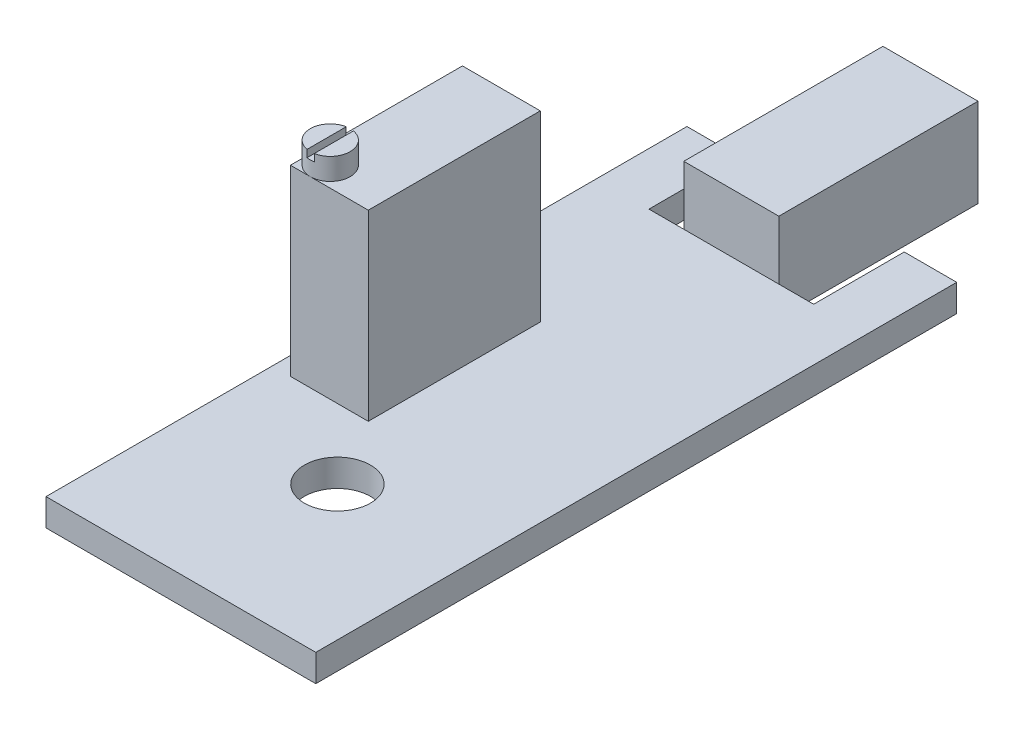
ISO-10303-21;
HEADER;
FILE_DESCRIPTION(('STEP AP214'),'2;1');
FILE_NAME('part.step','',(''),(''),'','','');
FILE_SCHEMA(('AUTOMOTIVE_DESIGN { 1 0 10303 214 1 1 1 1 }'));
ENDSEC;
DATA;
#1=APPLICATION_CONTEXT('core data for automotive mechanical design processes');
#2=APPLICATION_PROTOCOL_DEFINITION('international standard','automotive_design',2000,#1);
#3=PRODUCT_CONTEXT('',#1,'mechanical');
#4=PRODUCT('Part','Part','',(#3));
#5=PRODUCT_RELATED_PRODUCT_CATEGORY('part','',(#4));
#6=PRODUCT_DEFINITION_FORMATION('','',#4);
#7=PRODUCT_DEFINITION_CONTEXT('part definition',#1,'design');
#8=PRODUCT_DEFINITION('design','',#6,#7);
#9=PRODUCT_DEFINITION_SHAPE('','',#8);
#10=(LENGTH_UNIT() NAMED_UNIT(*) SI_UNIT(.MILLI.,.METRE.));
#11=(NAMED_UNIT(*) PLANE_ANGLE_UNIT() SI_UNIT($,.RADIAN.));
#12=(NAMED_UNIT(*) SI_UNIT($,.STERADIAN.) SOLID_ANGLE_UNIT());
#13=UNCERTAINTY_MEASURE_WITH_UNIT(LENGTH_MEASURE(1.E-05),#10,'distance_accuracy_value','');
#14=(GEOMETRIC_REPRESENTATION_CONTEXT(3) GLOBAL_UNCERTAINTY_ASSIGNED_CONTEXT((#13)) GLOBAL_UNIT_ASSIGNED_CONTEXT((#10,
#11,#12)) REPRESENTATION_CONTEXT('',''));
#15=CARTESIAN_POINT('',(0.,0.,0.));
#16=DIRECTION('',(0.,0.,1.));
#17=DIRECTION('',(1.,0.,0.));
#18=AXIS2_PLACEMENT_3D('',#15,#16,#17);
#19=CARTESIAN_POINT('',(-5.35,12.05,4.1));
#20=DIRECTION('',(0.,1.,0.));
#21=DIRECTION('',(0.,0.,1.));
#22=AXIS2_PLACEMENT_3D('',#19,#20,#21);
#23=PLANE('',#22);
#24=DIRECTION('',(0.,0.,-1.));
#25=VECTOR('',#24,1.);
#26=CARTESIAN_POINT('',(-5.15,12.05,3.0183346173608));
#27=LINE('',#26,#25);
#28=CARTESIAN_POINT('',(-5.15,12.05,5.18166538263919));
#29=VERTEX_POINT('',#28);
#30=CARTESIAN_POINT('',(-5.15,12.05,3.0183346173608));
#31=VERTEX_POINT('',#30);
#32=EDGE_CURVE('E206',#29,#31,#27,.T.);
#33=ORIENTED_EDGE('',*,*,#32,.F.);
#34=CARTESIAN_POINT('',(-5.35,12.05,4.1));
#35=DIRECTION('',(0.,1.,0.));
#36=DIRECTION('',(0.,0.,1.));
#37=AXIS2_PLACEMENT_3D('',#34,#35,#36);
#38=CIRCLE('',#37,1.1);
#39=EDGE_CURVE('E220',#29,#31,#38,.T.);
#40=ORIENTED_EDGE('',*,*,#39,.T.);
#41=EDGE_LOOP('',(#33,#40));
#42=FACE_BOUND('',#41,.T.);
#43=ADVANCED_FACE('F36',(#42),#23,.T.);
#44=CARTESIAN_POINT('',(0.,10.85,0.));
#45=DIRECTION('',(0.,-1.,0.));
#46=DIRECTION('',(0.,0.,-1.));
#47=AXIS2_PLACEMENT_3D('',#44,#45,#46);
#48=PLANE('',#47);
#49=CARTESIAN_POINT('',(-5.35,10.85,4.1));
#50=DIRECTION('',(0.,1.,0.));
#51=DIRECTION('',(0.,0.,1.));
#52=AXIS2_PLACEMENT_3D('',#49,#50,#51);
#53=CIRCLE('',#52,1.1);
#54=CARTESIAN_POINT('',(-5.35,10.85,5.2));
#55=VERTEX_POINT('',#54);
#56=CARTESIAN_POINT('',(-6.45,10.85,4.1));
#57=VERTEX_POINT('',#56);
#58=EDGE_CURVE('E46',#55,#57,#53,.T.);
#59=ORIENTED_EDGE('',*,*,#58,.F.);
#60=DIRECTION('',(1.,0.,0.));
#61=VECTOR('',#60,1.);
#62=CARTESIAN_POINT('',(-6.45,10.85,5.2));
#63=LINE('',#62,#61);
#64=CARTESIAN_POINT('',(-2.15,10.85,5.2));
#65=VERTEX_POINT('',#64);
#66=EDGE_CURVE('E236',#55,#65,#63,.T.);
#67=ORIENTED_EDGE('',*,*,#66,.T.);
#68=DIRECTION('',(0.,0.,-1.));
#69=VECTOR('',#68,1.);
#70=CARTESIAN_POINT('',(-2.15,10.85,5.2));
#71=LINE('',#70,#69);
#72=CARTESIAN_POINT('',(-2.15,10.85,-4.3));
#73=VERTEX_POINT('',#72);
#74=EDGE_CURVE('E226',#65,#73,#71,.T.);
#75=ORIENTED_EDGE('',*,*,#74,.T.);
#76=DIRECTION('',(-1.,0.,0.));
#77=VECTOR('',#76,1.);
#78=CARTESIAN_POINT('',(-6.45,10.85,-4.3));
#79=LINE('',#78,#77);
#80=CARTESIAN_POINT('',(-6.45,10.85,-4.3));
#81=VERTEX_POINT('',#80);
#82=EDGE_CURVE('E229',#73,#81,#79,.T.);
#83=ORIENTED_EDGE('',*,*,#82,.T.);
#84=DIRECTION('',(0.,0.,1.));
#85=VECTOR('',#84,1.);
#86=CARTESIAN_POINT('',(-6.45,10.85,5.2));
#87=LINE('',#86,#85);
#88=EDGE_CURVE('E233',#81,#57,#87,.T.);
#89=ORIENTED_EDGE('',*,*,#88,.T.);
#90=EDGE_LOOP('',(#59,#67,#75,#83,#89));
#91=FACE_BOUND('',#90,.T.);
#92=ADVANCED_FACE('F436',(#91),#48,.F.);
#93=CARTESIAN_POINT('',(0.,0.75,0.));
#94=DIRECTION('',(0.,1.,0.));
#95=DIRECTION('',(0.,0.,1.));
#96=AXIS2_PLACEMENT_3D('',#93,#94,#95);
#97=PLANE('',#96);
#98=CARTESIAN_POINT('',(0.,0.75,9.055));
#99=DIRECTION('',(0.,1.,0.));
#100=DIRECTION('',(0.,0.,1.));
#101=AXIS2_PLACEMENT_3D('',#98,#99,#100);
#102=CIRCLE('',#101,1.825);
#103=CARTESIAN_POINT('',(0.,0.75,10.88));
#104=VERTEX_POINT('',#103);
#105=EDGE_CURVE('E297',#104,#104,#102,.T.);
#106=ORIENTED_EDGE('',*,*,#105,.F.);
#107=EDGE_LOOP('',(#106));
#108=FACE_BOUND('',#107,.T.);
#109=DIRECTION('',(0.,0.,1.));
#110=VECTOR('',#109,1.);
#111=CARTESIAN_POINT('',(-4.54999999999994,0.75,0.));
#112=LINE('',#111,#110);
#113=CARTESIAN_POINT('',(-4.55,0.75,-17.7));
#114=VERTEX_POINT('',#113);
#115=CARTESIAN_POINT('',(-4.54999999999998,0.75,-12.7));
#116=VERTEX_POINT('',#115);
#117=EDGE_CURVE('E300',#114,#116,#112,.T.);
#118=ORIENTED_EDGE('',*,*,#117,.F.);
#119=DIRECTION('',(1.,0.,0.));
#120=VECTOR('',#119,1.);
#121=CARTESIAN_POINT('',(0.,0.75,-17.7));
#122=LINE('',#121,#120);
#123=CARTESIAN_POINT('',(-7.45,0.75,-17.7));
#124=VERTEX_POINT('',#123);
#125=EDGE_CURVE('E304',#124,#114,#122,.T.);
#126=ORIENTED_EDGE('',*,*,#125,.F.);
#127=DIRECTION('',(0.,0.,1.));
#128=VECTOR('',#127,1.);
#129=CARTESIAN_POINT('',(-7.45,0.75,0.));
#130=LINE('',#129,#128);
#131=CARTESIAN_POINT('',(-7.45,0.75,17.7));
#132=VERTEX_POINT('',#131);
#133=EDGE_CURVE('E307',#124,#132,#130,.T.);
#134=ORIENTED_EDGE('',*,*,#133,.T.);
#135=DIRECTION('',(1.,0.,0.));
#136=VECTOR('',#135,1.);
#137=CARTESIAN_POINT('',(0.,0.75,17.7));
#138=LINE('',#137,#136);
#139=CARTESIAN_POINT('',(7.45,0.75,17.7));
#140=VERTEX_POINT('',#139);
#141=EDGE_CURVE('E310',#132,#140,#138,.T.);
#142=ORIENTED_EDGE('',*,*,#141,.T.);
#143=DIRECTION('',(0.,0.,1.));
#144=VECTOR('',#143,1.);
#145=CARTESIAN_POINT('',(7.45,0.75,0.));
#146=LINE('',#145,#144);
#147=CARTESIAN_POINT('',(7.45,0.75,-17.7));
#148=VERTEX_POINT('',#147);
#149=EDGE_CURVE('E312',#148,#140,#146,.T.);
#150=ORIENTED_EDGE('',*,*,#149,.F.);
#151=DIRECTION('',(-1.,0.,0.));
#152=VECTOR('',#151,1.);
#153=CARTESIAN_POINT('',(0.,0.75,-17.7));
#154=LINE('',#153,#152);
#155=CARTESIAN_POINT('',(4.55,0.75,-17.7));
#156=VERTEX_POINT('',#155);
#157=EDGE_CURVE('E315',#148,#156,#154,.T.);
#158=ORIENTED_EDGE('',*,*,#157,.T.);
#159=DIRECTION('',(0.,0.,1.));
#160=VECTOR('',#159,1.);
#161=CARTESIAN_POINT('',(4.54999999999994,0.75,0.));
#162=LINE('',#161,#160);
#163=CARTESIAN_POINT('',(4.54999999999998,0.75,-12.7));
#164=VERTEX_POINT('',#163);
#165=EDGE_CURVE('E318',#156,#164,#162,.T.);
#166=ORIENTED_EDGE('',*,*,#165,.T.);
#167=DIRECTION('',(-1.,0.,0.));
#168=VECTOR('',#167,1.);
#169=CARTESIAN_POINT('',(0.,0.75,-12.7));
#170=LINE('',#169,#168);
#171=CARTESIAN_POINT('',(2.625,0.75,-12.7));
#172=VERTEX_POINT('',#171);
#173=EDGE_CURVE('E322',#164,#172,#170,.T.);
#174=ORIENTED_EDGE('',*,*,#173,.T.);
#175=DIRECTION('',(1.,0.,0.));
#176=VECTOR('',#175,1.);
#177=CARTESIAN_POINT('',(0.,0.75,-12.7));
#178=LINE('',#177,#176);
#179=CARTESIAN_POINT('',(-2.625,0.75,-12.7));
#180=VERTEX_POINT('',#179);
#181=EDGE_CURVE('E282',#180,#172,#178,.T.);
#182=ORIENTED_EDGE('',*,*,#181,.F.);
#183=EDGE_CURVE('E321',#180,#116,#170,.T.);
#184=ORIENTED_EDGE('',*,*,#183,.T.);
#185=EDGE_LOOP('',(#118,#126,#134,#142,#150,#158,#166,#174,#182,#184));
#186=FACE_BOUND('',#185,.T.);
#187=DIRECTION('',(-1.,0.,0.));
#188=VECTOR('',#187,1.);
#189=CARTESIAN_POINT('',(-6.45,0.75,-4.3));
#190=LINE('',#189,#188);
#191=CARTESIAN_POINT('',(-2.15,0.75,-4.3));
#192=VERTEX_POINT('',#191);
#193=CARTESIAN_POINT('',(-6.45,0.75,-4.3));
#194=VERTEX_POINT('',#193);
#195=EDGE_CURVE('E242',#192,#194,#190,.T.);
#196=ORIENTED_EDGE('',*,*,#195,.F.);
#197=DIRECTION('',(0.,0.,-1.));
#198=VECTOR('',#197,1.);
#199=CARTESIAN_POINT('',(-2.15,0.75,5.2));
#200=LINE('',#199,#198);
#201=CARTESIAN_POINT('',(-2.15,0.75,5.2));
#202=VERTEX_POINT('',#201);
#203=EDGE_CURVE('E222',#202,#192,#200,.T.);
#204=ORIENTED_EDGE('',*,*,#203,.F.);
#205=DIRECTION('',(1.,0.,0.));
#206=VECTOR('',#205,1.);
#207=CARTESIAN_POINT('',(-6.45,0.75,5.2));
#208=LINE('',#207,#206);
#209=CARTESIAN_POINT('',(-6.45,0.75,5.2));
#210=VERTEX_POINT('',#209);
#211=EDGE_CURVE('E230',#210,#202,#208,.T.);
#212=ORIENTED_EDGE('',*,*,#211,.F.);
#213=DIRECTION('',(0.,0.,1.));
#214=VECTOR('',#213,1.);
#215=CARTESIAN_POINT('',(-6.45,0.75,5.2));
#216=LINE('',#215,#214);
#217=EDGE_CURVE('E244',#194,#210,#216,.T.);
#218=ORIENTED_EDGE('',*,*,#217,.F.);
#219=EDGE_LOOP('',(#196,#204,#212,#218));
#220=FACE_BOUND('',#219,.T.);
#221=ADVANCED_FACE('F389',(#108,#186,#220),#97,.T.);
#222=CARTESIAN_POINT('',(0.,0.75,-12.7));
#223=DIRECTION('',(0.,0.,1.));
#224=DIRECTION('',(1.,0.,0.));
#225=AXIS2_PLACEMENT_3D('',#222,#223,#224);
#226=PLANE('',#225);
#227=DIRECTION('',(0.,1.,0.));
#228=VECTOR('',#227,1.);
#229=CARTESIAN_POINT('',(-2.625,-0.9,-12.7));
#230=LINE('',#229,#228);
#231=CARTESIAN_POINT('',(-2.625,-0.75,-12.7));
#232=VERTEX_POINT('',#231);
#233=EDGE_CURVE('E291',#232,#180,#230,.T.);
#234=ORIENTED_EDGE('',*,*,#233,.F.);
#235=DIRECTION('',(-1.,0.,0.));
#236=VECTOR('',#235,1.);
#237=CARTESIAN_POINT('',(0.,-0.75,-12.7));
#238=LINE('',#237,#236);
#239=CARTESIAN_POINT('',(-4.54999999999998,-0.75,-12.7));
#240=VERTEX_POINT('',#239);
#241=EDGE_CURVE('E349',#232,#240,#238,.T.);
#242=ORIENTED_EDGE('',*,*,#241,.T.);
#243=DIRECTION('',(0.,-1.,0.));
#244=VECTOR('',#243,1.);
#245=CARTESIAN_POINT('',(-4.54999999999998,0.75,-12.7));
#246=LINE('',#245,#244);
#247=EDGE_CURVE('E325',#116,#240,#246,.T.);
#248=ORIENTED_EDGE('',*,*,#247,.F.);
#249=ORIENTED_EDGE('',*,*,#183,.F.);
#250=EDGE_LOOP('',(#234,#242,#248,#249));
#251=FACE_BOUND('',#250,.T.);
#252=ADVANCED_FACE('F395',(#251),#226,.F.);
#253=CARTESIAN_POINT('',(-4.54999999999994,0.75,0.));
#254=DIRECTION('',(1.,0.,0.));
#255=DIRECTION('',(0.,0.,-1.));
#256=AXIS2_PLACEMENT_3D('',#253,#254,#255);
#257=PLANE('',#256);
#258=DIRECTION('',(0.,0.,1.));
#259=VECTOR('',#258,1.);
#260=CARTESIAN_POINT('',(-4.54999999999994,-0.75,0.));
#261=LINE('',#260,#259);
#262=CARTESIAN_POINT('',(-4.55,-0.75,-17.7));
#263=VERTEX_POINT('',#262);
#264=EDGE_CURVE('E328',#263,#240,#261,.T.);
#265=ORIENTED_EDGE('',*,*,#264,.F.);
#266=DIRECTION('',(0.,-1.,0.));
#267=VECTOR('',#266,1.);
#268=CARTESIAN_POINT('',(-4.55,0.75,-17.7));
#269=LINE('',#268,#267);
#270=EDGE_CURVE('E40',#114,#263,#269,.T.);
#271=ORIENTED_EDGE('',*,*,#270,.F.);
#272=ORIENTED_EDGE('',*,*,#117,.T.);
#273=ORIENTED_EDGE('',*,*,#247,.T.);
#274=EDGE_LOOP('',(#265,#271,#272,#273));
#275=FACE_BOUND('',#274,.T.);
#276=ADVANCED_FACE('F378',(#275),#257,.T.);
#277=CARTESIAN_POINT('',(0.,0.75,-17.7));
#278=DIRECTION('',(0.,0.,-1.));
#279=DIRECTION('',(-1.,0.,0.));
#280=AXIS2_PLACEMENT_3D('',#277,#278,#279);
#281=PLANE('',#280);
#282=DIRECTION('',(1.,0.,0.));
#283=VECTOR('',#282,1.);
#284=CARTESIAN_POINT('',(0.,-0.75,-17.7));
#285=LINE('',#284,#283);
#286=CARTESIAN_POINT('',(-7.45,-0.75,-17.7));
#287=VERTEX_POINT('',#286);
#288=EDGE_CURVE('E331',#287,#263,#285,.T.);
#289=ORIENTED_EDGE('',*,*,#288,.F.);
#290=DIRECTION('',(0.,-1.,0.));
#291=VECTOR('',#290,1.);
#292=CARTESIAN_POINT('',(-7.45,0.75,-17.7));
#293=LINE('',#292,#291);
#294=EDGE_CURVE('E367',#124,#287,#293,.T.);
#295=ORIENTED_EDGE('',*,*,#294,.F.);
#296=ORIENTED_EDGE('',*,*,#125,.T.);
#297=ORIENTED_EDGE('',*,*,#270,.T.);
#298=EDGE_LOOP('',(#289,#295,#296,#297));
#299=FACE_BOUND('',#298,.T.);
#300=ADVANCED_FACE('F374',(#299),#281,.T.);
#301=CARTESIAN_POINT('',(-7.45,0.75,0.));
#302=DIRECTION('',(1.,0.,0.));
#303=DIRECTION('',(0.,0.,-1.));
#304=AXIS2_PLACEMENT_3D('',#301,#302,#303);
#305=PLANE('',#304);
#306=DIRECTION('',(0.,0.,1.));
#307=VECTOR('',#306,1.);
#308=CARTESIAN_POINT('',(-7.45,-0.75,0.));
#309=LINE('',#308,#307);
#310=CARTESIAN_POINT('',(-7.45,-0.75,17.7));
#311=VERTEX_POINT('',#310);
#312=EDGE_CURVE('E334',#287,#311,#309,.T.);
#313=ORIENTED_EDGE('',*,*,#312,.T.);
#314=DIRECTION('',(0.,-1.,0.));
#315=VECTOR('',#314,1.);
#316=CARTESIAN_POINT('',(-7.45,0.75,17.7));
#317=LINE('',#316,#315);
#318=EDGE_CURVE('E365',#132,#311,#317,.T.);
#319=ORIENTED_EDGE('',*,*,#318,.F.);
#320=ORIENTED_EDGE('',*,*,#133,.F.);
#321=ORIENTED_EDGE('',*,*,#294,.T.);
#322=EDGE_LOOP('',(#313,#319,#320,#321));
#323=FACE_BOUND('',#322,.T.);
#324=ADVANCED_FACE('F383',(#323),#305,.F.);
#325=CARTESIAN_POINT('',(0.,0.75,17.7));
#326=DIRECTION('',(0.,0.,-1.));
#327=DIRECTION('',(-1.,0.,0.));
#328=AXIS2_PLACEMENT_3D('',#325,#326,#327);
#329=PLANE('',#328);
#330=DIRECTION('',(1.,0.,0.));
#331=VECTOR('',#330,1.);
#332=CARTESIAN_POINT('',(0.,-0.75,17.7));
#333=LINE('',#332,#331);
#334=CARTESIAN_POINT('',(7.45,-0.75,17.7));
#335=VERTEX_POINT('',#334);
#336=EDGE_CURVE('E337',#311,#335,#333,.T.);
#337=ORIENTED_EDGE('',*,*,#336,.T.);
#338=DIRECTION('',(0.,-1.,0.));
#339=VECTOR('',#338,1.);
#340=CARTESIAN_POINT('',(7.45,0.75,17.7));
#341=LINE('',#340,#339);
#342=EDGE_CURVE('E363',#140,#335,#341,.T.);
#343=ORIENTED_EDGE('',*,*,#342,.F.);
#344=ORIENTED_EDGE('',*,*,#141,.F.);
#345=ORIENTED_EDGE('',*,*,#318,.T.);
#346=EDGE_LOOP('',(#337,#343,#344,#345));
#347=FACE_BOUND('',#346,.T.);
#348=ADVANCED_FACE('F385',(#347),#329,.F.);
#349=CARTESIAN_POINT('',(7.45,0.75,0.));
#350=DIRECTION('',(1.,0.,0.));
#351=DIRECTION('',(0.,0.,-1.));
#352=AXIS2_PLACEMENT_3D('',#349,#350,#351);
#353=PLANE('',#352);
#354=DIRECTION('',(0.,0.,1.));
#355=VECTOR('',#354,1.);
#356=CARTESIAN_POINT('',(7.45,-0.75,0.));
#357=LINE('',#356,#355);
#358=CARTESIAN_POINT('',(7.45,-0.75,-17.7));
#359=VERTEX_POINT('',#358);
#360=EDGE_CURVE('E340',#359,#335,#357,.T.);
#361=ORIENTED_EDGE('',*,*,#360,.F.);
#362=DIRECTION('',(0.,-1.,0.));
#363=VECTOR('',#362,1.);
#364=CARTESIAN_POINT('',(7.45,0.75,-17.7));
#365=LINE('',#364,#363);
#366=EDGE_CURVE('E361',#148,#359,#365,.T.);
#367=ORIENTED_EDGE('',*,*,#366,.F.);
#368=ORIENTED_EDGE('',*,*,#149,.T.);
#369=ORIENTED_EDGE('',*,*,#342,.T.);
#370=EDGE_LOOP('',(#361,#367,#368,#369));
#371=FACE_BOUND('',#370,.T.);
#372=ADVANCED_FACE('F600',(#371),#353,.T.);
#373=CARTESIAN_POINT('',(0.,0.75,-17.7));
#374=DIRECTION('',(0.,0.,1.));
#375=DIRECTION('',(1.,0.,0.));
#376=AXIS2_PLACEMENT_3D('',#373,#374,#375);
#377=PLANE('',#376);
#378=DIRECTION('',(-1.,0.,0.));
#379=VECTOR('',#378,1.);
#380=CARTESIAN_POINT('',(0.,-0.75,-17.7));
#381=LINE('',#380,#379);
#382=CARTESIAN_POINT('',(4.55,-0.75,-17.7));
#383=VERTEX_POINT('',#382);
#384=EDGE_CURVE('E343',#359,#383,#381,.T.);
#385=ORIENTED_EDGE('',*,*,#384,.T.);
#386=DIRECTION('',(0.,-1.,0.));
#387=VECTOR('',#386,1.);
#388=CARTESIAN_POINT('',(4.55,0.75,-17.7));
#389=LINE('',#388,#387);
#390=EDGE_CURVE('E358',#156,#383,#389,.T.);
#391=ORIENTED_EDGE('',*,*,#390,.F.);
#392=ORIENTED_EDGE('',*,*,#157,.F.);
#393=ORIENTED_EDGE('',*,*,#366,.T.);
#394=EDGE_LOOP('',(#385,#391,#392,#393));
#395=FACE_BOUND('',#394,.T.);
#396=ADVANCED_FACE('F607',(#395),#377,.F.);
#397=CARTESIAN_POINT('',(4.54999999999994,0.75,0.));
#398=DIRECTION('',(1.,0.,0.));
#399=DIRECTION('',(0.,0.,-1.));
#400=AXIS2_PLACEMENT_3D('',#397,#398,#399);
#401=PLANE('',#400);
#402=DIRECTION('',(0.,0.,1.));
#403=VECTOR('',#402,1.);
#404=CARTESIAN_POINT('',(4.54999999999994,-0.75,0.));
#405=LINE('',#404,#403);
#406=CARTESIAN_POINT('',(4.54999999999998,-0.75,-12.7));
#407=VERTEX_POINT('',#406);
#408=EDGE_CURVE('E346',#383,#407,#405,.T.);
#409=ORIENTED_EDGE('',*,*,#408,.T.);
#410=DIRECTION('',(0.,-1.,0.));
#411=VECTOR('',#410,1.);
#412=CARTESIAN_POINT('',(4.54999999999998,0.75,-12.7));
#413=LINE('',#412,#411);
#414=EDGE_CURVE('E355',#164,#407,#413,.T.);
#415=ORIENTED_EDGE('',*,*,#414,.F.);
#416=ORIENTED_EDGE('',*,*,#165,.F.);
#417=ORIENTED_EDGE('',*,*,#390,.T.);
#418=EDGE_LOOP('',(#409,#415,#416,#417));
#419=FACE_BOUND('',#418,.T.);
#420=ADVANCED_FACE('F615',(#419),#401,.F.);
#421=CARTESIAN_POINT('',(0.,0.75,9.055));
#422=DIRECTION('',(0.,-1.,0.));
#423=DIRECTION('',(0.,0.,-1.));
#424=AXIS2_PLACEMENT_3D('',#421,#422,#423);
#425=CYLINDRICAL_SURFACE('',#424,1.825);
#426=ORIENTED_EDGE('',*,*,#105,.T.);
#427=EDGE_LOOP('',(#426));
#428=FACE_BOUND('',#427,.T.);
#429=CARTESIAN_POINT('',(0.,-0.75,9.055));
#430=DIRECTION('',(0.,1.,0.));
#431=DIRECTION('',(0.,0.,1.));
#432=AXIS2_PLACEMENT_3D('',#429,#430,#431);
#433=CIRCLE('',#432,1.825);
#434=CARTESIAN_POINT('',(0.,-0.75,10.88));
#435=VERTEX_POINT('',#434);
#436=EDGE_CURVE('E296',#435,#435,#433,.T.);
#437=ORIENTED_EDGE('',*,*,#436,.F.);
#438=EDGE_LOOP('',(#437));
#439=FACE_BOUND('',#438,.T.);
#440=ADVANCED_FACE('F38',(#428,#439),#425,.F.);
#441=CARTESIAN_POINT('',(2.625,-0.75,-12.7));
#442=VERTEX_POINT('',#441);
#443=EDGE_CURVE('E301',#407,#442,#238,.T.);
#444=ORIENTED_EDGE('',*,*,#443,.T.);
#445=DIRECTION('',(0.,1.,0.));
#446=VECTOR('',#445,1.);
#447=CARTESIAN_POINT('',(2.625,-0.9,-12.7));
#448=LINE('',#447,#446);
#449=EDGE_CURVE('E286',#442,#172,#448,.T.);
#450=ORIENTED_EDGE('',*,*,#449,.T.);
#451=ORIENTED_EDGE('',*,*,#173,.F.);
#452=ORIENTED_EDGE('',*,*,#414,.T.);
#453=EDGE_LOOP('',(#444,#450,#451,#452));
#454=FACE_BOUND('',#453,.T.);
#455=ADVANCED_FACE('F575',(#454),#226,.F.);
#456=CARTESIAN_POINT('',(0.,-0.75,0.));
#457=DIRECTION('',(0.,1.,0.));
#458=DIRECTION('',(0.,0.,1.));
#459=AXIS2_PLACEMENT_3D('',#456,#457,#458);
#460=PLANE('',#459);
#461=ORIENTED_EDGE('',*,*,#436,.T.);
#462=EDGE_LOOP('',(#461));
#463=FACE_BOUND('',#462,.T.);
#464=ORIENTED_EDGE('',*,*,#264,.T.);
#465=ORIENTED_EDGE('',*,*,#241,.F.);
#466=EDGE_CURVE('E352',#442,#232,#238,.T.);
#467=ORIENTED_EDGE('',*,*,#466,.F.);
#468=ORIENTED_EDGE('',*,*,#443,.F.);
#469=ORIENTED_EDGE('',*,*,#408,.F.);
#470=ORIENTED_EDGE('',*,*,#384,.F.);
#471=ORIENTED_EDGE('',*,*,#360,.T.);
#472=ORIENTED_EDGE('',*,*,#336,.F.);
#473=ORIENTED_EDGE('',*,*,#312,.F.);
#474=ORIENTED_EDGE('',*,*,#288,.T.);
#475=EDGE_LOOP('',(#464,#465,#467,#468,#469,#470,#471,#472,#473,#474));
#476=FACE_BOUND('',#475,.T.);
#477=ADVANCED_FACE('F381',(#463,#476),#460,.F.);
#478=CARTESIAN_POINT('',(0.,-0.9,-12.7));
#479=DIRECTION('',(0.,0.,1.));
#480=DIRECTION('',(1.,0.,0.));
#481=AXIS2_PLACEMENT_3D('',#478,#479,#480);
#482=PLANE('',#481);
#483=ORIENTED_EDGE('',*,*,#466,.T.);
#484=CARTESIAN_POINT('',(-2.625,-0.9,-12.7));
#485=VERTEX_POINT('',#484);
#486=EDGE_CURVE('E288',#485,#232,#230,.T.);
#487=ORIENTED_EDGE('',*,*,#486,.F.);
#488=DIRECTION('',(1.,0.,0.));
#489=VECTOR('',#488,1.);
#490=CARTESIAN_POINT('',(0.,-0.9,-12.7));
#491=LINE('',#490,#489);
#492=CARTESIAN_POINT('',(2.625,-0.9,-12.7));
#493=VERTEX_POINT('',#492);
#494=EDGE_CURVE('E273',#485,#493,#491,.T.);
#495=ORIENTED_EDGE('',*,*,#494,.T.);
#496=EDGE_CURVE('E283',#493,#442,#448,.T.);
#497=ORIENTED_EDGE('',*,*,#496,.T.);
#498=EDGE_LOOP('',(#483,#487,#495,#497));
#499=FACE_BOUND('',#498,.T.);
#500=ADVANCED_FACE('F399',(#499),#482,.T.);
#501=CARTESIAN_POINT('',(0.,-0.9,-23.7));
#502=DIRECTION('',(0.,0.,1.));
#503=DIRECTION('',(1.,0.,0.));
#504=AXIS2_PLACEMENT_3D('',#501,#502,#503);
#505=PLANE('',#504);
#506=DIRECTION('',(0.,1.,0.));
#507=VECTOR('',#506,1.);
#508=CARTESIAN_POINT('',(-2.625,-0.9,-23.7));
#509=LINE('',#508,#507);
#510=CARTESIAN_POINT('',(-2.625,-0.9,-23.7));
#511=VERTEX_POINT('',#510);
#512=CARTESIAN_POINT('',(-2.625,4.,-23.7));
#513=VERTEX_POINT('',#512);
#514=EDGE_CURVE('E279',#511,#513,#509,.T.);
#515=ORIENTED_EDGE('',*,*,#514,.T.);
#516=DIRECTION('',(1.,0.,0.));
#517=VECTOR('',#516,1.);
#518=CARTESIAN_POINT('',(0.,4.,-23.7));
#519=LINE('',#518,#517);
#520=CARTESIAN_POINT('',(2.625,4.,-23.7));
#521=VERTEX_POINT('',#520);
#522=EDGE_CURVE('E257',#513,#521,#519,.T.);
#523=ORIENTED_EDGE('',*,*,#522,.T.);
#524=DIRECTION('',(0.,1.,0.));
#525=VECTOR('',#524,1.);
#526=CARTESIAN_POINT('',(2.625,-0.9,-23.7));
#527=LINE('',#526,#525);
#528=CARTESIAN_POINT('',(2.625,-0.9,-23.7));
#529=VERTEX_POINT('',#528);
#530=EDGE_CURVE('E280',#529,#521,#527,.T.);
#531=ORIENTED_EDGE('',*,*,#530,.F.);
#532=DIRECTION('',(1.,0.,0.));
#533=VECTOR('',#532,1.);
#534=CARTESIAN_POINT('',(0.,-0.9,-23.7));
#535=LINE('',#534,#533);
#536=EDGE_CURVE('E269',#511,#529,#535,.T.);
#537=ORIENTED_EDGE('',*,*,#536,.F.);
#538=EDGE_LOOP('',(#515,#523,#531,#537));
#539=FACE_BOUND('',#538,.T.);
#540=ADVANCED_FACE('F424',(#539),#505,.F.);
#541=CARTESIAN_POINT('',(2.625,-0.9,0.));
#542=DIRECTION('',(1.,0.,0.));
#543=DIRECTION('',(0.,0.,-1.));
#544=AXIS2_PLACEMENT_3D('',#541,#542,#543);
#545=PLANE('',#544);
#546=ORIENTED_EDGE('',*,*,#530,.T.);
#547=DIRECTION('',(0.,0.,-1.));
#548=VECTOR('',#547,1.);
#549=CARTESIAN_POINT('',(2.625,4.,0.));
#550=LINE('',#549,#548);
#551=CARTESIAN_POINT('',(2.625,4.,-12.7));
#552=VERTEX_POINT('',#551);
#553=EDGE_CURVE('E266',#552,#521,#550,.T.);
#554=ORIENTED_EDGE('',*,*,#553,.F.);
#555=EDGE_CURVE('E287',#172,#552,#448,.T.);
#556=ORIENTED_EDGE('',*,*,#555,.F.);
#557=ORIENTED_EDGE('',*,*,#449,.F.);
#558=ORIENTED_EDGE('',*,*,#496,.F.);
#559=DIRECTION('',(0.,0.,-1.));
#560=VECTOR('',#559,1.);
#561=CARTESIAN_POINT('',(2.625,-0.9,0.));
#562=LINE('',#561,#560);
#563=EDGE_CURVE('E276',#493,#529,#562,.T.);
#564=ORIENTED_EDGE('',*,*,#563,.T.);
#565=EDGE_LOOP('',(#546,#554,#556,#557,#558,#564));
#566=FACE_BOUND('',#565,.T.);
#567=ADVANCED_FACE('F411',(#566),#545,.T.);
#568=CARTESIAN_POINT('',(-2.625,4.,-12.7));
#569=VERTEX_POINT('',#568);
#570=EDGE_CURVE('E292',#180,#569,#230,.T.);
#571=ORIENTED_EDGE('',*,*,#570,.F.);
#572=ORIENTED_EDGE('',*,*,#181,.T.);
#573=ORIENTED_EDGE('',*,*,#555,.T.);
#574=DIRECTION('',(1.,0.,0.));
#575=VECTOR('',#574,1.);
#576=CARTESIAN_POINT('',(0.,4.,-12.7));
#577=LINE('',#576,#575);
#578=EDGE_CURVE('E263',#569,#552,#577,.T.);
#579=ORIENTED_EDGE('',*,*,#578,.F.);
#580=EDGE_LOOP('',(#571,#572,#573,#579));
#581=FACE_BOUND('',#580,.T.);
#582=ADVANCED_FACE('F418',(#581),#482,.T.);
#583=CARTESIAN_POINT('',(-2.625,-0.9,0.));
#584=DIRECTION('',(1.,0.,0.));
#585=DIRECTION('',(0.,0.,-1.));
#586=AXIS2_PLACEMENT_3D('',#583,#584,#585);
#587=PLANE('',#586);
#588=ORIENTED_EDGE('',*,*,#486,.T.);
#589=ORIENTED_EDGE('',*,*,#233,.T.);
#590=ORIENTED_EDGE('',*,*,#570,.T.);
#591=DIRECTION('',(0.,0.,-1.));
#592=VECTOR('',#591,1.);
#593=CARTESIAN_POINT('',(-2.625,4.,0.));
#594=LINE('',#593,#592);
#595=EDGE_CURVE('E260',#569,#513,#594,.T.);
#596=ORIENTED_EDGE('',*,*,#595,.T.);
#597=ORIENTED_EDGE('',*,*,#514,.F.);
#598=DIRECTION('',(0.,0.,-1.));
#599=VECTOR('',#598,1.);
#600=CARTESIAN_POINT('',(-2.625,-0.9,0.));
#601=LINE('',#600,#599);
#602=EDGE_CURVE('E271',#485,#511,#601,.T.);
#603=ORIENTED_EDGE('',*,*,#602,.F.);
#604=EDGE_LOOP('',(#588,#589,#590,#596,#597,#603));
#605=FACE_BOUND('',#604,.T.);
#606=ADVANCED_FACE('F402',(#605),#587,.F.);
#607=CARTESIAN_POINT('',(0.,-0.9,0.));
#608=DIRECTION('',(0.,1.,0.));
#609=DIRECTION('',(0.,0.,1.));
#610=AXIS2_PLACEMENT_3D('',#607,#608,#609);
#611=PLANE('',#610);
#612=ORIENTED_EDGE('',*,*,#536,.T.);
#613=ORIENTED_EDGE('',*,*,#563,.F.);
#614=ORIENTED_EDGE('',*,*,#494,.F.);
#615=ORIENTED_EDGE('',*,*,#602,.T.);
#616=EDGE_LOOP('',(#612,#613,#614,#615));
#617=FACE_BOUND('',#616,.T.);
#618=ADVANCED_FACE('F408',(#617),#611,.F.);
#619=CARTESIAN_POINT('',(0.,4.,0.));
#620=DIRECTION('',(0.,1.,0.));
#621=DIRECTION('',(0.,0.,1.));
#622=AXIS2_PLACEMENT_3D('',#619,#620,#621);
#623=PLANE('',#622);
#624=ORIENTED_EDGE('',*,*,#522,.F.);
#625=ORIENTED_EDGE('',*,*,#595,.F.);
#626=ORIENTED_EDGE('',*,*,#578,.T.);
#627=ORIENTED_EDGE('',*,*,#553,.T.);
#628=EDGE_LOOP('',(#624,#625,#626,#627));
#629=FACE_BOUND('',#628,.T.);
#630=ADVANCED_FACE('F422',(#629),#623,.T.);
#631=CARTESIAN_POINT('',(-2.15,10.85,5.2));
#632=DIRECTION('',(-1.,0.,0.));
#633=DIRECTION('',(0.,0.,1.));
#634=AXIS2_PLACEMENT_3D('',#631,#632,#633);
#635=PLANE('',#634);
#636=ORIENTED_EDGE('',*,*,#203,.T.);
#637=DIRECTION('',(0.,-1.,0.));
#638=VECTOR('',#637,1.);
#639=CARTESIAN_POINT('',(-2.15,10.85,-4.3));
#640=LINE('',#639,#638);
#641=EDGE_CURVE('E255',#73,#192,#640,.T.);
#642=ORIENTED_EDGE('',*,*,#641,.F.);
#643=ORIENTED_EDGE('',*,*,#74,.F.);
#644=DIRECTION('',(0.,-1.,0.));
#645=VECTOR('',#644,1.);
#646=CARTESIAN_POINT('',(-2.15,10.85,5.2));
#647=LINE('',#646,#645);
#648=EDGE_CURVE('E239',#65,#202,#647,.T.);
#649=ORIENTED_EDGE('',*,*,#648,.T.);
#650=EDGE_LOOP('',(#636,#642,#643,#649));
#651=FACE_BOUND('',#650,.T.);
#652=ADVANCED_FACE('F479',(#651),#635,.F.);
#653=CARTESIAN_POINT('',(-6.45,10.85,-4.3));
#654=DIRECTION('',(0.,0.,1.));
#655=DIRECTION('',(1.,0.,0.));
#656=AXIS2_PLACEMENT_3D('',#653,#654,#655);
#657=PLANE('',#656);
#658=ORIENTED_EDGE('',*,*,#195,.T.);
#659=DIRECTION('',(0.,-1.,0.));
#660=VECTOR('',#659,1.);
#661=CARTESIAN_POINT('',(-6.45,10.85,-4.3));
#662=LINE('',#661,#660);
#663=EDGE_CURVE('E252',#81,#194,#662,.T.);
#664=ORIENTED_EDGE('',*,*,#663,.F.);
#665=ORIENTED_EDGE('',*,*,#82,.F.);
#666=ORIENTED_EDGE('',*,*,#641,.T.);
#667=EDGE_LOOP('',(#658,#664,#665,#666));
#668=FACE_BOUND('',#667,.T.);
#669=ADVANCED_FACE('F475',(#668),#657,.F.);
#670=CARTESIAN_POINT('',(-6.45,10.85,5.2));
#671=DIRECTION('',(1.,0.,0.));
#672=DIRECTION('',(0.,0.,-1.));
#673=AXIS2_PLACEMENT_3D('',#670,#671,#672);
#674=PLANE('',#673);
#675=ORIENTED_EDGE('',*,*,#217,.T.);
#676=DIRECTION('',(0.,-1.,0.));
#677=VECTOR('',#676,1.);
#678=CARTESIAN_POINT('',(-6.45,10.85,5.2));
#679=LINE('',#678,#677);
#680=CARTESIAN_POINT('',(-6.45,10.85,5.2));
#681=VERTEX_POINT('',#680);
#682=EDGE_CURVE('E250',#681,#210,#679,.T.);
#683=ORIENTED_EDGE('',*,*,#682,.F.);
#684=EDGE_CURVE('E232',#57,#681,#87,.T.);
#685=ORIENTED_EDGE('',*,*,#684,.F.);
#686=ORIENTED_EDGE('',*,*,#88,.F.);
#687=ORIENTED_EDGE('',*,*,#663,.T.);
#688=EDGE_LOOP('',(#675,#683,#685,#686,#687));
#689=FACE_BOUND('',#688,.T.);
#690=ADVANCED_FACE('F471',(#689),#674,.F.);
#691=CARTESIAN_POINT('',(-6.45,10.85,5.2));
#692=DIRECTION('',(0.,0.,-1.));
#693=DIRECTION('',(-1.,0.,0.));
#694=AXIS2_PLACEMENT_3D('',#691,#692,#693);
#695=PLANE('',#694);
#696=ORIENTED_EDGE('',*,*,#211,.T.);
#697=ORIENTED_EDGE('',*,*,#648,.F.);
#698=ORIENTED_EDGE('',*,*,#66,.F.);
#699=EDGE_CURVE('E237',#681,#55,#63,.T.);
#700=ORIENTED_EDGE('',*,*,#699,.F.);
#701=ORIENTED_EDGE('',*,*,#682,.T.);
#702=EDGE_LOOP('',(#696,#697,#698,#700,#701));
#703=FACE_BOUND('',#702,.T.);
#704=ADVANCED_FACE('F467',(#703),#695,.F.);
#705=EDGE_CURVE('E11',#57,#55,#53,.T.);
#706=ORIENTED_EDGE('',*,*,#705,.F.);
#707=ORIENTED_EDGE('',*,*,#684,.T.);
#708=ORIENTED_EDGE('',*,*,#699,.T.);
#709=EDGE_LOOP('',(#706,#707,#708));
#710=FACE_BOUND('',#709,.T.);
#711=ADVANCED_FACE('F445',(#710),#48,.F.);
#712=CARTESIAN_POINT('',(-5.35,12.05,4.1));
#713=DIRECTION('',(0.,-1.,0.));
#714=DIRECTION('',(0.,0.,-1.));
#715=AXIS2_PLACEMENT_3D('',#712,#713,#714);
#716=CYLINDRICAL_SURFACE('',#715,1.1);
#717=ORIENTED_EDGE('',*,*,#39,.F.);
#718=DIRECTION('',(0.,1.,0.));
#719=VECTOR('',#718,1.);
#720=CARTESIAN_POINT('',(-5.15,11.65,5.18166538263919));
#721=LINE('',#720,#719);
#722=CARTESIAN_POINT('',(-5.15,11.65,5.18166538263919));
#723=VERTEX_POINT('',#722);
#724=EDGE_CURVE('E215',#723,#29,#721,.T.);
#725=ORIENTED_EDGE('',*,*,#724,.F.);
#726=CARTESIAN_POINT('',(-5.35,11.65,4.09999999999999));
#727=DIRECTION('',(0.,1.,0.));
#728=DIRECTION('',(0.,0.,1.));
#729=AXIS2_PLACEMENT_3D('',#726,#727,#728);
#730=CIRCLE('',#729,1.10000000000001);
#731=CARTESIAN_POINT('',(-5.55,11.65,5.18166538263919));
#732=VERTEX_POINT('',#731);
#733=EDGE_CURVE('E196',#732,#723,#730,.T.);
#734=ORIENTED_EDGE('',*,*,#733,.F.);
#735=DIRECTION('',(0.,1.,0.));
#736=VECTOR('',#735,1.);
#737=CARTESIAN_POINT('',(-5.55,11.65,5.18166538263919));
#738=LINE('',#737,#736);
#739=CARTESIAN_POINT('',(-5.55,12.05,5.18166538263919));
#740=VERTEX_POINT('',#739);
#741=EDGE_CURVE('E193',#732,#740,#738,.T.);
#742=ORIENTED_EDGE('',*,*,#741,.T.);
#743=CARTESIAN_POINT('',(-5.55,12.05,3.0183346173608));
#744=VERTEX_POINT('',#743);
#745=EDGE_CURVE('E213',#744,#740,#38,.T.);
#746=ORIENTED_EDGE('',*,*,#745,.F.);
#747=DIRECTION('',(0.,1.,0.));
#748=VECTOR('',#747,1.);
#749=CARTESIAN_POINT('',(-5.55,11.65,3.0183346173608));
#750=LINE('',#749,#748);
#751=CARTESIAN_POINT('',(-5.55,11.65,3.0183346173608));
#752=VERTEX_POINT('',#751);
#753=EDGE_CURVE('E53',#752,#744,#750,.T.);
#754=ORIENTED_EDGE('',*,*,#753,.F.);
#755=CARTESIAN_POINT('',(-5.35,11.65,4.10000000000005));
#756=DIRECTION('',(0.,1.,0.));
#757=DIRECTION('',(0.,0.,-1.));
#758=AXIS2_PLACEMENT_3D('',#755,#756,#757);
#759=CIRCLE('',#758,1.10000000000005);
#760=CARTESIAN_POINT('',(-5.15,11.65,3.0183346173608));
#761=VERTEX_POINT('',#760);
#762=EDGE_CURVE('E197',#761,#752,#759,.T.);
#763=ORIENTED_EDGE('',*,*,#762,.F.);
#764=DIRECTION('',(0.,1.,0.));
#765=VECTOR('',#764,1.);
#766=CARTESIAN_POINT('',(-5.15,11.65,3.0183346173608));
#767=LINE('',#766,#765);
#768=EDGE_CURVE('E225',#761,#31,#767,.T.);
#769=ORIENTED_EDGE('',*,*,#768,.T.);
#770=EDGE_LOOP('',(#717,#725,#734,#742,#746,#754,#763,#769));
#771=FACE_BOUND('',#770,.T.);
#772=ORIENTED_EDGE('',*,*,#58,.T.);
#773=ORIENTED_EDGE('',*,*,#705,.T.);
#774=EDGE_LOOP('',(#772,#773));
#775=FACE_BOUND('',#774,.T.);
#776=ADVANCED_FACE('F210',(#771,#775),#716,.T.);
#777=DIRECTION('',(0.,0.,1.));
#778=VECTOR('',#777,1.);
#779=CARTESIAN_POINT('',(-5.55,12.05,3.0183346173608));
#780=LINE('',#779,#778);
#781=EDGE_CURVE('E458',#744,#740,#780,.T.);
#782=ORIENTED_EDGE('',*,*,#781,.F.);
#783=ORIENTED_EDGE('',*,*,#745,.T.);
#784=EDGE_LOOP('',(#782,#783));
#785=FACE_BOUND('',#784,.T.);
#786=ADVANCED_FACE('F439',(#785),#23,.T.);
#787=CARTESIAN_POINT('',(-5.15,11.65,3.0183346173608));
#788=DIRECTION('',(1.,0.,0.));
#789=DIRECTION('',(0.,0.,-1.));
#790=AXIS2_PLACEMENT_3D('',#787,#788,#789);
#791=PLANE('',#790);
#792=ORIENTED_EDGE('',*,*,#32,.T.);
#793=ORIENTED_EDGE('',*,*,#768,.F.);
#794=DIRECTION('',(0.,0.,-1.));
#795=VECTOR('',#794,1.);
#796=CARTESIAN_POINT('',(-5.15,11.65,3.0183346173608));
#797=LINE('',#796,#795);
#798=EDGE_CURVE('E203',#723,#761,#797,.T.);
#799=ORIENTED_EDGE('',*,*,#798,.F.);
#800=ORIENTED_EDGE('',*,*,#724,.T.);
#801=EDGE_LOOP('',(#792,#793,#799,#800));
#802=FACE_BOUND('',#801,.T.);
#803=ADVANCED_FACE('F450',(#802),#791,.F.);
#804=CARTESIAN_POINT('',(-5.55,11.65,3.0183346173608));
#805=DIRECTION('',(-1.,0.,0.));
#806=DIRECTION('',(0.,0.,1.));
#807=AXIS2_PLACEMENT_3D('',#804,#805,#806);
#808=PLANE('',#807);
#809=ORIENTED_EDGE('',*,*,#781,.T.);
#810=ORIENTED_EDGE('',*,*,#741,.F.);
#811=DIRECTION('',(0.,0.,1.));
#812=VECTOR('',#811,1.);
#813=CARTESIAN_POINT('',(-5.55,11.65,3.0183346173608));
#814=LINE('',#813,#812);
#815=EDGE_CURVE('E189',#752,#732,#814,.T.);
#816=ORIENTED_EDGE('',*,*,#815,.F.);
#817=ORIENTED_EDGE('',*,*,#753,.T.);
#818=EDGE_LOOP('',(#809,#810,#816,#817));
#819=FACE_BOUND('',#818,.T.);
#820=ADVANCED_FACE('F191',(#819),#808,.F.);
#821=CARTESIAN_POINT('',(-5.35,11.65,4.10000000000005));
#822=DIRECTION('',(0.,-1.,0.));
#823=DIRECTION('',(0.,0.,-1.));
#824=AXIS2_PLACEMENT_3D('',#821,#822,#823);
#825=PLANE('',#824);
#826=ORIENTED_EDGE('',*,*,#762,.T.);
#827=ORIENTED_EDGE('',*,*,#815,.T.);
#828=ORIENTED_EDGE('',*,*,#733,.T.);
#829=ORIENTED_EDGE('',*,*,#798,.T.);
#830=EDGE_LOOP('',(#826,#827,#828,#829));
#831=FACE_BOUND('',#830,.T.);
#832=ADVANCED_FACE('F201',(#831),#825,.F.);
#833=CLOSED_SHELL('',(#43,#92,#221,#252,#276,#300,#324,#348,#372,#396,#420,#440,#455,#477,#500,
#540,#567,#582,#606,#618,#630,#652,#669,#690,#704,#711,#776,#786,#803,#820,#832));
#834=MANIFOLD_SOLID_BREP('B2',#833);
#835=ADVANCED_BREP_SHAPE_REPRESENTATION('',(#18,#834),#14);
#836=SHAPE_DEFINITION_REPRESENTATION(#9,#835);
ENDSEC;
END-ISO-10303-21;
